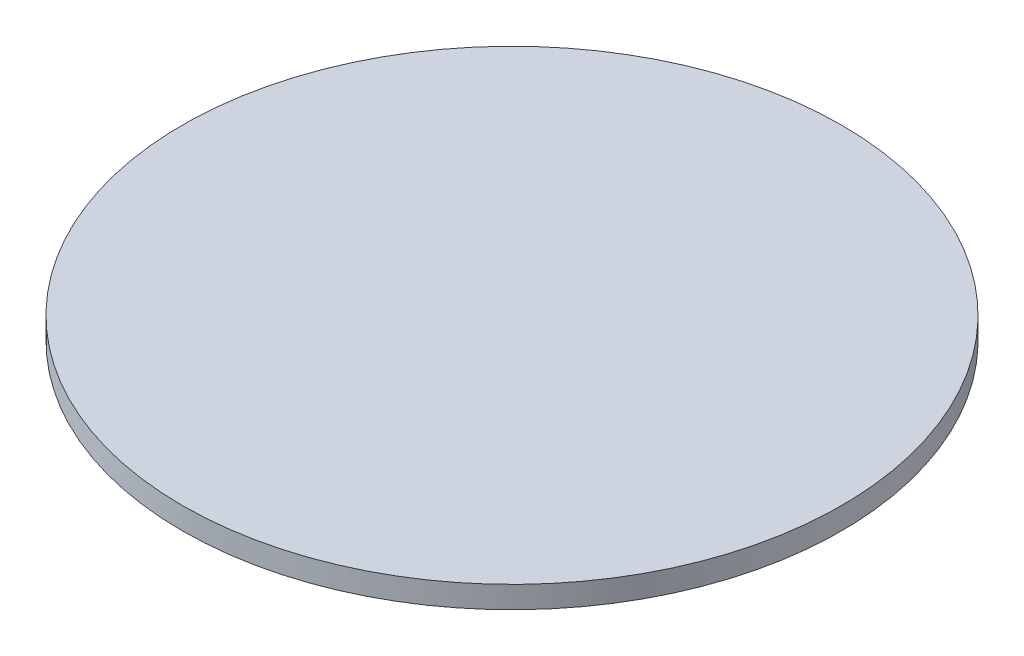
ISO-10303-21;
HEADER;
FILE_DESCRIPTION(('STEP AP214'),'2;1');
FILE_NAME('part.step','',(''),(''),'','','');
FILE_SCHEMA(('AUTOMOTIVE_DESIGN { 1 0 10303 214 1 1 1 1 }'));
ENDSEC;
DATA;
#1=APPLICATION_CONTEXT('core data for automotive mechanical design processes');
#2=APPLICATION_PROTOCOL_DEFINITION('international standard','automotive_design',2000,#1);
#3=PRODUCT_CONTEXT('',#1,'mechanical');
#4=PRODUCT('Part','Part','',(#3));
#5=PRODUCT_RELATED_PRODUCT_CATEGORY('part','',(#4));
#6=PRODUCT_DEFINITION_FORMATION('','',#4);
#7=PRODUCT_DEFINITION_CONTEXT('part definition',#1,'design');
#8=PRODUCT_DEFINITION('design','',#6,#7);
#9=PRODUCT_DEFINITION_SHAPE('','',#8);
#10=(LENGTH_UNIT() NAMED_UNIT(*) SI_UNIT(.MILLI.,.METRE.));
#11=(NAMED_UNIT(*) PLANE_ANGLE_UNIT() SI_UNIT($,.RADIAN.));
#12=(NAMED_UNIT(*) SI_UNIT($,.STERADIAN.) SOLID_ANGLE_UNIT());
#13=UNCERTAINTY_MEASURE_WITH_UNIT(LENGTH_MEASURE(1.E-05),#10,'distance_accuracy_value','');
#14=(GEOMETRIC_REPRESENTATION_CONTEXT(3) GLOBAL_UNCERTAINTY_ASSIGNED_CONTEXT((#13)) GLOBAL_UNIT_ASSIGNED_CONTEXT((#10,
#11,#12)) REPRESENTATION_CONTEXT('',''));
#15=CARTESIAN_POINT('',(0.,0.,0.));
#16=DIRECTION('',(0.,0.,1.));
#17=DIRECTION('',(1.,0.,0.));
#18=AXIS2_PLACEMENT_3D('',#15,#16,#17);
#19=CARTESIAN_POINT('',(0.,0.1,0.));
#20=DIRECTION('',(0.,-1.,0.));
#21=DIRECTION('',(0.,0.,-1.));
#22=AXIS2_PLACEMENT_3D('',#19,#20,#21);
#23=CYLINDRICAL_SURFACE('',#22,1.5);
#24=CARTESIAN_POINT('',(0.,0.1,0.));
#25=DIRECTION('',(0.,1.,0.));
#26=DIRECTION('',(0.,0.,1.));
#27=AXIS2_PLACEMENT_3D('',#24,#25,#26);
#28=CIRCLE('',#27,1.5);
#29=CARTESIAN_POINT('',(0.,0.1,1.5));
#30=VERTEX_POINT('',#29);
#31=EDGE_CURVE('E10',#30,#30,#28,.T.);
#32=ORIENTED_EDGE('',*,*,#31,.F.);
#33=EDGE_LOOP('',(#32));
#34=FACE_BOUND('',#33,.T.);
#35=CARTESIAN_POINT('',(0.,0.,0.));
#36=DIRECTION('',(0.,1.,0.));
#37=DIRECTION('',(0.,0.,1.));
#38=AXIS2_PLACEMENT_3D('',#35,#36,#37);
#39=CIRCLE('',#38,1.5);
#40=CARTESIAN_POINT('',(0.,0.,1.5));
#41=VERTEX_POINT('',#40);
#42=EDGE_CURVE('E40',#41,#41,#39,.T.);
#43=ORIENTED_EDGE('',*,*,#42,.T.);
#44=EDGE_LOOP('',(#43));
#45=FACE_BOUND('',#44,.T.);
#46=ADVANCED_FACE('F37',(#34,#45),#23,.T.);
#47=CARTESIAN_POINT('',(0.,0.1,0.));
#48=DIRECTION('',(0.,1.,0.));
#49=DIRECTION('',(0.,0.,1.));
#50=AXIS2_PLACEMENT_3D('',#47,#48,#49);
#51=PLANE('',#50);
#52=ORIENTED_EDGE('',*,*,#31,.T.);
#53=EDGE_LOOP('',(#52));
#54=FACE_BOUND('',#53,.T.);
#55=ADVANCED_FACE('F54',(#54),#51,.T.);
#56=CARTESIAN_POINT('',(0.,0.,0.));
#57=DIRECTION('',(0.,1.,0.));
#58=DIRECTION('',(0.,0.,1.));
#59=AXIS2_PLACEMENT_3D('',#56,#57,#58);
#60=PLANE('',#59);
#61=ORIENTED_EDGE('',*,*,#42,.F.);
#62=EDGE_LOOP('',(#61));
#63=FACE_BOUND('',#62,.T.);
#64=ADVANCED_FACE('F52',(#63),#60,.F.);
#65=CLOSED_SHELL('',(#46,#55,#64));
#66=MANIFOLD_SOLID_BREP('B2',#65);
#67=ADVANCED_BREP_SHAPE_REPRESENTATION('',(#18,#66),#14);
#68=SHAPE_DEFINITION_REPRESENTATION(#9,#67);
ENDSEC;
END-ISO-10303-21;
